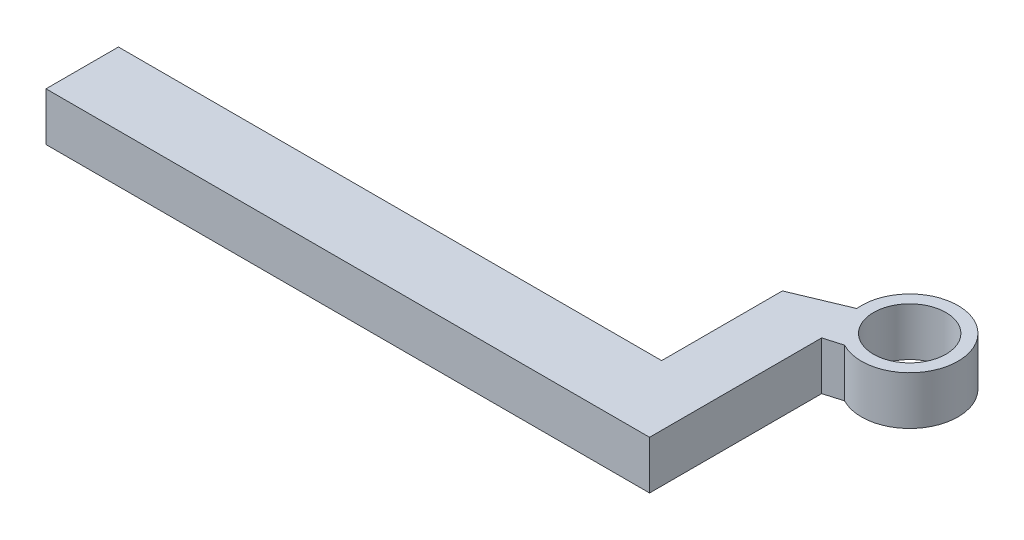
ISO-10303-21;
HEADER;
FILE_DESCRIPTION(('STEP AP214'),'2;1');
FILE_NAME('part.step','',(''),(''),'','','');
FILE_SCHEMA(('AUTOMOTIVE_DESIGN { 1 0 10303 214 1 1 1 1 }'));
ENDSEC;
DATA;
#1=APPLICATION_CONTEXT('core data for automotive mechanical design processes');
#2=APPLICATION_PROTOCOL_DEFINITION('international standard','automotive_design',2000,#1);
#3=PRODUCT_CONTEXT('',#1,'mechanical');
#4=PRODUCT('Part','Part','',(#3));
#5=PRODUCT_RELATED_PRODUCT_CATEGORY('part','',(#4));
#6=PRODUCT_DEFINITION_FORMATION('','',#4);
#7=PRODUCT_DEFINITION_CONTEXT('part definition',#1,'design');
#8=PRODUCT_DEFINITION('design','',#6,#7);
#9=PRODUCT_DEFINITION_SHAPE('','',#8);
#10=(LENGTH_UNIT() NAMED_UNIT(*) SI_UNIT(.MILLI.,.METRE.));
#11=(NAMED_UNIT(*) PLANE_ANGLE_UNIT() SI_UNIT($,.RADIAN.));
#12=(NAMED_UNIT(*) SI_UNIT($,.STERADIAN.) SOLID_ANGLE_UNIT());
#13=UNCERTAINTY_MEASURE_WITH_UNIT(LENGTH_MEASURE(1.E-05),#10,'distance_accuracy_value','');
#14=(GEOMETRIC_REPRESENTATION_CONTEXT(3) GLOBAL_UNCERTAINTY_ASSIGNED_CONTEXT((#13)) GLOBAL_UNIT_ASSIGNED_CONTEXT((#10,
#11,#12)) REPRESENTATION_CONTEXT('',''));
#15=CARTESIAN_POINT('',(0.,0.,0.));
#16=DIRECTION('',(0.,0.,1.));
#17=DIRECTION('',(1.,0.,0.));
#18=AXIS2_PLACEMENT_3D('',#15,#16,#17);
#19=CARTESIAN_POINT('',(200.,40.,-30.));
#20=DIRECTION('',(-1.,0.,0.));
#21=DIRECTION('',(0.,0.,1.));
#22=AXIS2_PLACEMENT_3D('',#19,#20,#21);
#23=PLANE('',#22);
#24=DIRECTION('',(0.,0.,-1.));
#25=VECTOR('',#24,1.);
#26=CARTESIAN_POINT('',(200.,0.,-30.));
#27=LINE('',#26,#25);
#28=CARTESIAN_POINT('',(200.,0.,-30.));
#29=VERTEX_POINT('',#28);
#30=CARTESIAN_POINT('',(200.,0.,-130.));
#31=VERTEX_POINT('',#30);
#32=EDGE_CURVE('E135',#29,#31,#27,.T.);
#33=ORIENTED_EDGE('',*,*,#32,.F.);
#34=DIRECTION('',(0.,-1.,0.));
#35=VECTOR('',#34,1.);
#36=CARTESIAN_POINT('',(200.,40.,-30.));
#37=LINE('',#36,#35);
#38=CARTESIAN_POINT('',(200.,40.,-30.));
#39=VERTEX_POINT('',#38);
#40=EDGE_CURVE('E11',#39,#29,#37,.T.);
#41=ORIENTED_EDGE('',*,*,#40,.F.);
#42=DIRECTION('',(0.,0.,-1.));
#43=VECTOR('',#42,1.);
#44=CARTESIAN_POINT('',(200.,40.,-30.));
#45=LINE('',#44,#43);
#46=CARTESIAN_POINT('',(200.,40.,-130.));
#47=VERTEX_POINT('',#46);
#48=EDGE_CURVE('E162',#39,#47,#45,.T.);
#49=ORIENTED_EDGE('',*,*,#48,.T.);
#50=DIRECTION('',(0.,-1.,0.));
#51=VECTOR('',#50,1.);
#52=CARTESIAN_POINT('',(200.,40.,-130.));
#53=LINE('',#52,#51);
#54=EDGE_CURVE('E90',#47,#31,#53,.T.);
#55=ORIENTED_EDGE('',*,*,#54,.T.);
#56=EDGE_LOOP('',(#33,#41,#49,#55));
#57=FACE_BOUND('',#56,.T.);
#58=ADVANCED_FACE('F36',(#57),#23,.T.);
#59=CARTESIAN_POINT('',(200.,40.,-30.));
#60=DIRECTION('',(0.,0.,1.));
#61=DIRECTION('',(1.,0.,0.));
#62=AXIS2_PLACEMENT_3D('',#59,#60,#61);
#63=PLANE('',#62);
#64=DIRECTION('',(-1.,0.,0.));
#65=VECTOR('',#64,1.);
#66=CARTESIAN_POINT('',(200.,0.,-30.));
#67=LINE('',#66,#65);
#68=CARTESIAN_POINT('',(-250.,0.,-30.));
#69=VERTEX_POINT('',#68);
#70=EDGE_CURVE('E81',#29,#69,#67,.T.);
#71=ORIENTED_EDGE('',*,*,#70,.T.);
#72=DIRECTION('',(0.,-1.,0.));
#73=VECTOR('',#72,1.);
#74=CARTESIAN_POINT('',(-250.,40.,-30.));
#75=LINE('',#74,#73);
#76=CARTESIAN_POINT('',(-250.,40.,-30.));
#77=VERTEX_POINT('',#76);
#78=EDGE_CURVE('E45',#77,#69,#75,.T.);
#79=ORIENTED_EDGE('',*,*,#78,.F.);
#80=DIRECTION('',(-1.,0.,0.));
#81=VECTOR('',#80,1.);
#82=CARTESIAN_POINT('',(200.,40.,-30.));
#83=LINE('',#82,#81);
#84=EDGE_CURVE('E113',#39,#77,#83,.T.);
#85=ORIENTED_EDGE('',*,*,#84,.F.);
#86=ORIENTED_EDGE('',*,*,#40,.T.);
#87=EDGE_LOOP('',(#71,#79,#85,#86));
#88=FACE_BOUND('',#87,.T.);
#89=ADVANCED_FACE('F223',(#88),#63,.F.);
#90=CARTESIAN_POINT('',(-250.,40.,-30.));
#91=DIRECTION('',(1.,0.,0.));
#92=DIRECTION('',(0.,0.,-1.));
#93=AXIS2_PLACEMENT_3D('',#90,#91,#92);
#94=PLANE('',#93);
#95=DIRECTION('',(0.,0.,1.));
#96=VECTOR('',#95,1.);
#97=CARTESIAN_POINT('',(-250.,0.,-30.));
#98=LINE('',#97,#96);
#99=CARTESIAN_POINT('',(-250.,0.,30.));
#100=VERTEX_POINT('',#99);
#101=EDGE_CURVE('E120',#69,#100,#98,.T.);
#102=ORIENTED_EDGE('',*,*,#101,.T.);
#103=DIRECTION('',(0.,-1.,0.));
#104=VECTOR('',#103,1.);
#105=CARTESIAN_POINT('',(-250.,40.,30.));
#106=LINE('',#105,#104);
#107=CARTESIAN_POINT('',(-250.,40.,30.));
#108=VERTEX_POINT('',#107);
#109=EDGE_CURVE('E117',#108,#100,#106,.T.);
#110=ORIENTED_EDGE('',*,*,#109,.F.);
#111=DIRECTION('',(0.,0.,1.));
#112=VECTOR('',#111,1.);
#113=CARTESIAN_POINT('',(-250.,40.,-30.));
#114=LINE('',#113,#112);
#115=EDGE_CURVE('E107',#77,#108,#114,.T.);
#116=ORIENTED_EDGE('',*,*,#115,.F.);
#117=ORIENTED_EDGE('',*,*,#78,.T.);
#118=EDGE_LOOP('',(#102,#110,#116,#117));
#119=FACE_BOUND('',#118,.T.);
#120=ADVANCED_FACE('F118',(#119),#94,.F.);
#121=CARTESIAN_POINT('',(250.,40.,30.));
#122=DIRECTION('',(0.,0.,1.));
#123=DIRECTION('',(1.,0.,0.));
#124=AXIS2_PLACEMENT_3D('',#121,#122,#123);
#125=PLANE('',#124);
#126=DIRECTION('',(-1.,0.,0.));
#127=VECTOR('',#126,1.);
#128=CARTESIAN_POINT('',(250.,0.,30.));
#129=LINE('',#128,#127);
#130=CARTESIAN_POINT('',(250.,0.,30.));
#131=VERTEX_POINT('',#130);
#132=EDGE_CURVE('E159',#131,#100,#129,.T.);
#133=ORIENTED_EDGE('',*,*,#132,.F.);
#134=DIRECTION('',(0.,-1.,0.));
#135=VECTOR('',#134,1.);
#136=CARTESIAN_POINT('',(250.,40.,30.));
#137=LINE('',#136,#135);
#138=CARTESIAN_POINT('',(250.,40.,30.));
#139=VERTEX_POINT('',#138);
#140=EDGE_CURVE('E124',#139,#131,#137,.T.);
#141=ORIENTED_EDGE('',*,*,#140,.F.);
#142=DIRECTION('',(-1.,0.,0.));
#143=VECTOR('',#142,1.);
#144=CARTESIAN_POINT('',(250.,40.,30.));
#145=LINE('',#144,#143);
#146=EDGE_CURVE('E112',#139,#108,#145,.T.);
#147=ORIENTED_EDGE('',*,*,#146,.T.);
#148=ORIENTED_EDGE('',*,*,#109,.T.);
#149=EDGE_LOOP('',(#133,#141,#147,#148));
#150=FACE_BOUND('',#149,.T.);
#151=ADVANCED_FACE('F127',(#150),#125,.T.);
#152=CARTESIAN_POINT('',(250.,40.,-30.));
#153=DIRECTION('',(1.,0.,0.));
#154=DIRECTION('',(0.,0.,-1.));
#155=AXIS2_PLACEMENT_3D('',#152,#153,#154);
#156=PLANE('',#155);
#157=DIRECTION('',(0.,0.,1.));
#158=VECTOR('',#157,1.);
#159=CARTESIAN_POINT('',(250.,0.,-30.));
#160=LINE('',#159,#158);
#161=CARTESIAN_POINT('',(250.,0.,-112.573687243933));
#162=VERTEX_POINT('',#161);
#163=EDGE_CURVE('E153',#162,#131,#160,.T.);
#164=ORIENTED_EDGE('',*,*,#163,.F.);
#165=DIRECTION('',(0.,-1.,0.));
#166=VECTOR('',#165,1.);
#167=CARTESIAN_POINT('',(250.,40.,-112.573687243933));
#168=LINE('',#167,#166);
#169=CARTESIAN_POINT('',(250.,40.,-112.573687243933));
#170=VERTEX_POINT('',#169);
#171=EDGE_CURVE('E166',#170,#162,#168,.T.);
#172=ORIENTED_EDGE('',*,*,#171,.F.);
#173=DIRECTION('',(0.,0.,-1.));
#174=VECTOR('',#173,1.);
#175=CARTESIAN_POINT('',(250.,40.,-30.));
#176=LINE('',#175,#174);
#177=EDGE_CURVE('E128',#139,#170,#176,.T.);
#178=ORIENTED_EDGE('',*,*,#177,.F.);
#179=ORIENTED_EDGE('',*,*,#140,.T.);
#180=EDGE_LOOP('',(#164,#172,#178,#179));
#181=FACE_BOUND('',#180,.T.);
#182=ADVANCED_FACE('F181',(#181),#156,.T.);
#183=CARTESIAN_POINT('',(250.,40.,-112.573687243933));
#184=DIRECTION('',(-0.281212558058602,0.,-0.959645506002158));
#185=DIRECTION('',(-0.959645506002158,0.,0.281212558058602));
#186=AXIS2_PLACEMENT_3D('',#183,#184,#185);
#187=PLANE('',#186);
#188=CARTESIAN_POINT('',(250.,0.,-112.573687243933));
#189=CARTESIAN_POINT('',(257.325533589733,0.,-114.720346637458));
#190=CARTESIAN_POINT('',(264.651067179467,0.,-116.867006030983));
#191=B_SPLINE_CURVE_WITH_KNOTS('',2,(#188,#189,#190),.UNSPECIFIED.,.F.,.F.,(3,3),(0.,
0.441237608916753),.UNSPECIFIED.);
#192=CARTESIAN_POINT('',(264.651067179467,0.,-116.867006030983));
#193=VERTEX_POINT('',#192);
#194=EDGE_CURVE('E149',#162,#193,#191,.T.);
#195=ORIENTED_EDGE('',*,*,#194,.T.);
#196=DIRECTION('',(0.,-1.,0.));
#197=VECTOR('',#196,1.);
#198=CARTESIAN_POINT('',(264.651067179467,40.,-116.867006030983));
#199=LINE('',#198,#197);
#200=CARTESIAN_POINT('',(264.651067179467,40.,-116.867006030983));
#201=VERTEX_POINT('',#200);
#202=EDGE_CURVE('E169',#201,#193,#199,.T.);
#203=ORIENTED_EDGE('',*,*,#202,.F.);
#204=CARTESIAN_POINT('',(250.,40.,-112.573687243933));
#205=CARTESIAN_POINT('',(257.325533589733,40.,-114.720346637458));
#206=CARTESIAN_POINT('',(264.651067179467,40.,-116.867006030983));
#207=B_SPLINE_CURVE_WITH_KNOTS('',2,(#204,#205,#206),.UNSPECIFIED.,.F.,.F.,(3,3),(0.,
0.441237608916753),.UNSPECIFIED.);
#208=EDGE_CURVE('E130',#170,#201,#207,.T.);
#209=ORIENTED_EDGE('',*,*,#208,.F.);
#210=ORIENTED_EDGE('',*,*,#171,.T.);
#211=EDGE_LOOP('',(#195,#203,#209,#210));
#212=FACE_BOUND('',#211,.T.);
#213=ADVANCED_FACE('F184',(#212),#187,.F.);
#214=CARTESIAN_POINT('',(283.204484122366,40.,-152.303861418318));
#215=DIRECTION('',(0.,-1.,0.));
#216=DIRECTION('',(0.,0.,-1.));
#217=AXIS2_PLACEMENT_3D('',#214,#215,#216);
#218=CYLINDRICAL_SURFACE('',#217,40.);
#219=CARTESIAN_POINT('',(283.204484122366,0.,-152.303861418318));
#220=DIRECTION('',(0.,1.,0.));
#221=DIRECTION('',(0.,0.,1.));
#222=AXIS2_PLACEMENT_3D('',#219,#220,#221);
#223=CIRCLE('',#222,40.);
#224=CARTESIAN_POINT('',(243.415537745307,0.,-148.200235435908));
#225=VERTEX_POINT('',#224);
#226=EDGE_CURVE('E143',#193,#225,#223,.T.);
#227=ORIENTED_EDGE('',*,*,#226,.T.);
#228=DIRECTION('',(0.,-1.,0.));
#229=VECTOR('',#228,1.);
#230=CARTESIAN_POINT('',(243.415537745307,40.,-148.200235435908));
#231=LINE('',#230,#229);
#232=CARTESIAN_POINT('',(243.415537745307,40.,-148.200235435908));
#233=VERTEX_POINT('',#232);
#234=EDGE_CURVE('E172',#233,#225,#231,.T.);
#235=ORIENTED_EDGE('',*,*,#234,.F.);
#236=CARTESIAN_POINT('',(283.204484122366,40.,-152.303861418318));
#237=DIRECTION('',(0.,1.,0.));
#238=DIRECTION('',(0.,0.,1.));
#239=AXIS2_PLACEMENT_3D('',#236,#237,#238);
#240=CIRCLE('',#239,40.);
#241=EDGE_CURVE('E187',#201,#233,#240,.T.);
#242=ORIENTED_EDGE('',*,*,#241,.F.);
#243=ORIENTED_EDGE('',*,*,#202,.T.);
#244=EDGE_LOOP('',(#227,#235,#242,#243));
#245=FACE_BOUND('',#244,.T.);
#246=ADVANCED_FACE('F238',(#245),#218,.T.);
#247=CARTESIAN_POINT('',(200.,40.,-130.));
#248=DIRECTION('',(-0.386613216286417,0.,-0.9222419536069));
#249=DIRECTION('',(-0.9222419536069,0.,0.386613216286417));
#250=AXIS2_PLACEMENT_3D('',#247,#248,#249);
#251=PLANE('',#250);
#252=CARTESIAN_POINT('',(200.,0.,-130.));
#253=CARTESIAN_POINT('',(221.707768872653,0.,-139.100117717954));
#254=CARTESIAN_POINT('',(243.415537745307,0.,-148.200235435908));
#255=B_SPLINE_CURVE_WITH_KNOTS('',2,(#252,#253,#254),.UNSPECIFIED.,.F.,.F.,(3,3),(0.,
0.816012756470953),.UNSPECIFIED.);
#256=EDGE_CURVE('E138',#31,#225,#255,.T.);
#257=ORIENTED_EDGE('',*,*,#256,.F.);
#258=ORIENTED_EDGE('',*,*,#54,.F.);
#259=CARTESIAN_POINT('',(200.,40.,-130.));
#260=CARTESIAN_POINT('',(221.707768872653,40.,-139.100117717954));
#261=CARTESIAN_POINT('',(243.415537745307,40.,-148.200235435908));
#262=B_SPLINE_CURVE_WITH_KNOTS('',2,(#259,#260,#261),.UNSPECIFIED.,.F.,.F.,(3,3),(0.,
0.816012756470953),.UNSPECIFIED.);
#263=EDGE_CURVE('E188',#47,#233,#262,.T.);
#264=ORIENTED_EDGE('',*,*,#263,.T.);
#265=ORIENTED_EDGE('',*,*,#234,.T.);
#266=EDGE_LOOP('',(#257,#258,#264,#265));
#267=FACE_BOUND('',#266,.T.);
#268=ADVANCED_FACE('F173',(#267),#251,.T.);
#269=CARTESIAN_POINT('',(283.204484122366,40.,-152.303861418318));
#270=DIRECTION('',(0.,1.,0.));
#271=DIRECTION('',(0.,0.,1.));
#272=AXIS2_PLACEMENT_3D('',#269,#270,#271);
#273=PLANE('',#272);
#274=CARTESIAN_POINT('',(283.204484122366,40.,-152.303861418318));
#275=DIRECTION('',(0.,1.,0.));
#276=DIRECTION('',(0.,0.,1.));
#277=AXIS2_PLACEMENT_3D('',#274,#275,#276);
#278=CIRCLE('',#277,30.);
#279=CARTESIAN_POINT('',(283.204484122366,40.,-122.303861418318));
#280=VERTEX_POINT('',#279);
#281=EDGE_CURVE('E203',#280,#280,#278,.F.);
#282=ORIENTED_EDGE('',*,*,#281,.T.);
#283=EDGE_LOOP('',(#282));
#284=FACE_BOUND('',#283,.T.);
#285=ORIENTED_EDGE('',*,*,#48,.F.);
#286=ORIENTED_EDGE('',*,*,#84,.T.);
#287=ORIENTED_EDGE('',*,*,#115,.T.);
#288=ORIENTED_EDGE('',*,*,#146,.F.);
#289=ORIENTED_EDGE('',*,*,#177,.T.);
#290=ORIENTED_EDGE('',*,*,#208,.T.);
#291=ORIENTED_EDGE('',*,*,#241,.T.);
#292=ORIENTED_EDGE('',*,*,#263,.F.);
#293=EDGE_LOOP('',(#285,#286,#287,#288,#289,#290,#291,#292));
#294=FACE_BOUND('',#293,.T.);
#295=ADVANCED_FACE('F110',(#284,#294),#273,.T.);
#296=CARTESIAN_POINT('',(283.204484122366,0.,-152.303861418318));
#297=DIRECTION('',(0.,1.,0.));
#298=DIRECTION('',(0.,0.,1.));
#299=AXIS2_PLACEMENT_3D('',#296,#297,#298);
#300=PLANE('',#299);
#301=CARTESIAN_POINT('',(283.204484122366,0.,-152.303861418318));
#302=DIRECTION('',(0.,1.,0.));
#303=DIRECTION('',(0.,0.,1.));
#304=AXIS2_PLACEMENT_3D('',#301,#302,#303);
#305=CIRCLE('',#304,30.);
#306=CARTESIAN_POINT('',(283.204484122366,0.,-122.303861418318));
#307=VERTEX_POINT('',#306);
#308=EDGE_CURVE('E39',#307,#307,#305,.F.);
#309=ORIENTED_EDGE('',*,*,#308,.F.);
#310=EDGE_LOOP('',(#309));
#311=FACE_BOUND('',#310,.T.);
#312=ORIENTED_EDGE('',*,*,#32,.T.);
#313=ORIENTED_EDGE('',*,*,#256,.T.);
#314=ORIENTED_EDGE('',*,*,#226,.F.);
#315=ORIENTED_EDGE('',*,*,#194,.F.);
#316=ORIENTED_EDGE('',*,*,#163,.T.);
#317=ORIENTED_EDGE('',*,*,#132,.T.);
#318=ORIENTED_EDGE('',*,*,#101,.F.);
#319=ORIENTED_EDGE('',*,*,#70,.F.);
#320=EDGE_LOOP('',(#312,#313,#314,#315,#316,#317,#318,#319));
#321=FACE_BOUND('',#320,.T.);
#322=ADVANCED_FACE('F177',(#311,#321),#300,.F.);
#323=CARTESIAN_POINT('',(283.204484122366,-1.2E-05,-152.303861418318));
#324=DIRECTION('',(0.,1.,0.));
#325=DIRECTION('',(0.,0.,1.));
#326=AXIS2_PLACEMENT_3D('',#323,#324,#325);
#327=CYLINDRICAL_SURFACE('',#326,30.);
#328=ORIENTED_EDGE('',*,*,#281,.F.);
#329=EDGE_LOOP('',(#328));
#330=FACE_BOUND('',#329,.T.);
#331=ORIENTED_EDGE('',*,*,#308,.T.);
#332=EDGE_LOOP('',(#331));
#333=FACE_BOUND('',#332,.T.);
#334=ADVANCED_FACE('F210',(#330,#333),#327,.F.);
#335=CLOSED_SHELL('',(#58,#89,#120,#151,#182,#213,#246,#268,#295,#322,#334));
#336=MANIFOLD_SOLID_BREP('B2',#335);
#337=ADVANCED_BREP_SHAPE_REPRESENTATION('',(#18,#336),#14);
#338=SHAPE_DEFINITION_REPRESENTATION(#9,#337);
ENDSEC;
END-ISO-10303-21;
